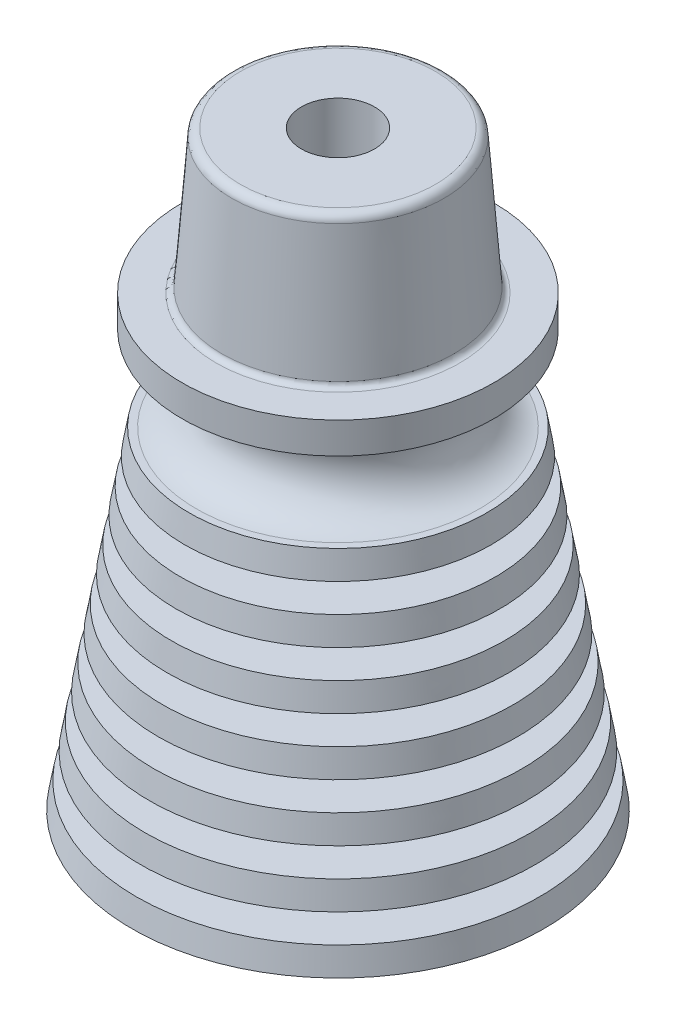
ISO-10303-21;
HEADER;
FILE_DESCRIPTION(('STEP AP214'),'2;1');
FILE_NAME('part.step','',(''),(''),'','','');
FILE_SCHEMA(('AUTOMOTIVE_DESIGN { 1 0 10303 214 1 1 1 1 }'));
ENDSEC;
DATA;
#1=APPLICATION_CONTEXT('core data for automotive mechanical design processes');
#2=APPLICATION_PROTOCOL_DEFINITION('international standard','automotive_design',2000,#1);
#3=PRODUCT_CONTEXT('',#1,'mechanical');
#4=PRODUCT('Part','Part','',(#3));
#5=PRODUCT_RELATED_PRODUCT_CATEGORY('part','',(#4));
#6=PRODUCT_DEFINITION_FORMATION('','',#4);
#7=PRODUCT_DEFINITION_CONTEXT('part definition',#1,'design');
#8=PRODUCT_DEFINITION('design','',#6,#7);
#9=PRODUCT_DEFINITION_SHAPE('','',#8);
#10=(LENGTH_UNIT() NAMED_UNIT(*) SI_UNIT(.MILLI.,.METRE.));
#11=(NAMED_UNIT(*) PLANE_ANGLE_UNIT() SI_UNIT($,.RADIAN.));
#12=(NAMED_UNIT(*) SI_UNIT($,.STERADIAN.) SOLID_ANGLE_UNIT());
#13=UNCERTAINTY_MEASURE_WITH_UNIT(LENGTH_MEASURE(1.E-05),#10,'distance_accuracy_value','');
#14=(GEOMETRIC_REPRESENTATION_CONTEXT(3) GLOBAL_UNCERTAINTY_ASSIGNED_CONTEXT((#13)) GLOBAL_UNIT_ASSIGNED_CONTEXT((#10,
#11,#12)) REPRESENTATION_CONTEXT('',''));
#15=CARTESIAN_POINT('',(0.,0.,0.));
#16=DIRECTION('',(0.,0.,1.));
#17=DIRECTION('',(1.,0.,0.));
#18=AXIS2_PLACEMENT_3D('',#15,#16,#17);
#19=CARTESIAN_POINT('',(0.,0.,0.));
#20=DIRECTION('',(0.,-1.,0.));
#21=DIRECTION('',(0.,0.,-1.));
#22=AXIS2_PLACEMENT_3D('',#19,#20,#21);
#23=CONICAL_SURFACE('',#22,6.23569725419736,0.111501419453793);
#24=CARTESIAN_POINT('',(0.,12.573,0.));
#25=DIRECTION('',(0.,1.,0.));
#26=DIRECTION('',(0.,0.,1.));
#27=AXIS2_PLACEMENT_3D('',#24,#25,#26);
#28=CIRCLE('',#27,4.82795110035121);
#29=CARTESIAN_POINT('',(0.,12.573,4.82795110035121));
#30=VERTEX_POINT('',#29);
#31=EDGE_CURVE('E56',#30,#30,#28,.F.);
#32=ORIENTED_EDGE('',*,*,#31,.F.);
#33=EDGE_LOOP('',(#32));
#34=FACE_BOUND('',#33,.T.);
#35=CARTESIAN_POINT('',(0.,13.716,0.));
#36=DIRECTION('',(0.,-1.,0.));
#37=DIRECTION('',(0.,0.,-1.));
#38=AXIS2_PLACEMENT_3D('',#35,#36,#37);
#39=CIRCLE('',#38,4.69997417727428);
#40=CARTESIAN_POINT('',(0.,13.716,-4.69997417727428));
#41=VERTEX_POINT('',#40);
#42=EDGE_CURVE('E89',#41,#41,#39,.F.);
#43=ORIENTED_EDGE('',*,*,#42,.F.);
#44=EDGE_LOOP('',(#43));
#45=FACE_BOUND('',#44,.T.);
#46=ADVANCED_FACE('F33',(#34,#45),#23,.T.);
#47=CARTESIAN_POINT('',(0.,9.144,0.));
#48=DIRECTION('',(0.,-1.,0.));
#49=DIRECTION('',(0.,0.,-1.));
#50=AXIS2_PLACEMENT_3D('',#47,#48,#49);
#51=CIRCLE('',#50,5.21188186958198);
#52=CARTESIAN_POINT('',(0.,9.144,-5.21188186958198));
#53=VERTEX_POINT('',#52);
#54=EDGE_CURVE('E62',#53,#53,#51,.F.);
#55=ORIENTED_EDGE('',*,*,#54,.F.);
#56=EDGE_LOOP('',(#55));
#57=FACE_BOUND('',#56,.T.);
#58=CARTESIAN_POINT('',(0.,8.001,0.));
#59=DIRECTION('',(0.,1.,0.));
#60=DIRECTION('',(0.,0.,1.));
#61=AXIS2_PLACEMENT_3D('',#58,#59,#60);
#62=CIRCLE('',#61,5.3398587926589);
#63=CARTESIAN_POINT('',(0.,8.001,5.3398587926589));
#64=VERTEX_POINT('',#63);
#65=EDGE_CURVE('E68',#64,#64,#62,.F.);
#66=ORIENTED_EDGE('',*,*,#65,.F.);
#67=EDGE_LOOP('',(#66));
#68=FACE_BOUND('',#67,.T.);
#69=ADVANCED_FACE('F173',(#57,#68),#23,.T.);
#70=CARTESIAN_POINT('',(0.,11.43,0.));
#71=DIRECTION('',(0.,-1.,0.));
#72=DIRECTION('',(0.,0.,-1.));
#73=AXIS2_PLACEMENT_3D('',#70,#71,#72);
#74=CIRCLE('',#73,4.95592802342813);
#75=CARTESIAN_POINT('',(0.,11.43,-4.95592802342813));
#76=VERTEX_POINT('',#75);
#77=EDGE_CURVE('E59',#76,#76,#74,.F.);
#78=ORIENTED_EDGE('',*,*,#77,.F.);
#79=EDGE_LOOP('',(#78));
#80=FACE_BOUND('',#79,.T.);
#81=CARTESIAN_POINT('',(0.,10.287,0.));
#82=DIRECTION('',(0.,1.,0.));
#83=DIRECTION('',(0.,0.,1.));
#84=AXIS2_PLACEMENT_3D('',#81,#82,#83);
#85=CIRCLE('',#84,5.08390494650505);
#86=CARTESIAN_POINT('',(0.,10.287,5.08390494650505));
#87=VERTEX_POINT('',#86);
#88=EDGE_CURVE('E65',#87,#87,#85,.F.);
#89=ORIENTED_EDGE('',*,*,#88,.F.);
#90=EDGE_LOOP('',(#89));
#91=FACE_BOUND('',#90,.T.);
#92=ADVANCED_FACE('F180',(#80,#91),#23,.T.);
#93=CARTESIAN_POINT('',(0.,6.858,0.));
#94=DIRECTION('',(0.,-1.,0.));
#95=DIRECTION('',(0.,0.,-1.));
#96=AXIS2_PLACEMENT_3D('',#93,#94,#95);
#97=CIRCLE('',#96,5.46783571573582);
#98=CARTESIAN_POINT('',(0.,6.858,-5.46783571573582));
#99=VERTEX_POINT('',#98);
#100=EDGE_CURVE('E71',#99,#99,#97,.F.);
#101=ORIENTED_EDGE('',*,*,#100,.F.);
#102=EDGE_LOOP('',(#101));
#103=FACE_BOUND('',#102,.T.);
#104=CARTESIAN_POINT('',(0.,5.715,0.));
#105=DIRECTION('',(0.,1.,0.));
#106=DIRECTION('',(0.,0.,1.));
#107=AXIS2_PLACEMENT_3D('',#104,#105,#106);
#108=CIRCLE('',#107,5.59581263881275);
#109=CARTESIAN_POINT('',(0.,5.715,5.59581263881275));
#110=VERTEX_POINT('',#109);
#111=EDGE_CURVE('E74',#110,#110,#108,.F.);
#112=ORIENTED_EDGE('',*,*,#111,.F.);
#113=EDGE_LOOP('',(#112));
#114=FACE_BOUND('',#113,.T.);
#115=ADVANCED_FACE('F202',(#103,#114),#23,.T.);
#116=CARTESIAN_POINT('',(0.,4.572,0.));
#117=DIRECTION('',(0.,-1.,0.));
#118=DIRECTION('',(0.,0.,-1.));
#119=AXIS2_PLACEMENT_3D('',#116,#117,#118);
#120=CIRCLE('',#119,5.72378956188967);
#121=CARTESIAN_POINT('',(0.,4.572,-5.72378956188967));
#122=VERTEX_POINT('',#121);
#123=EDGE_CURVE('E77',#122,#122,#120,.F.);
#124=ORIENTED_EDGE('',*,*,#123,.F.);
#125=EDGE_LOOP('',(#124));
#126=FACE_BOUND('',#125,.T.);
#127=CARTESIAN_POINT('',(0.,3.429,0.));
#128=DIRECTION('',(0.,1.,0.));
#129=DIRECTION('',(0.,0.,1.));
#130=AXIS2_PLACEMENT_3D('',#127,#128,#129);
#131=CIRCLE('',#130,5.85176648496659);
#132=CARTESIAN_POINT('',(0.,3.429,5.85176648496659));
#133=VERTEX_POINT('',#132);
#134=EDGE_CURVE('E80',#133,#133,#131,.F.);
#135=ORIENTED_EDGE('',*,*,#134,.F.);
#136=EDGE_LOOP('',(#135));
#137=FACE_BOUND('',#136,.T.);
#138=ADVANCED_FACE('F190',(#126,#137),#23,.T.);
#139=CARTESIAN_POINT('',(0.,14.859,0.));
#140=DIRECTION('',(0.,-1.,0.));
#141=DIRECTION('',(0.,0.,-1.));
#142=AXIS2_PLACEMENT_3D('',#139,#140,#141);
#143=CONICAL_SURFACE('',#142,2.5273,0.111501419453793);
#144=CARTESIAN_POINT('',(0.,0.,0.));
#145=DIRECTION('',(0.,-1.,0.));
#146=DIRECTION('',(0.,0.,-1.));
#147=AXIS2_PLACEMENT_3D('',#144,#145,#146);
#148=CIRCLE('',#147,4.191);
#149=CARTESIAN_POINT('',(0.,0.,-4.191));
#150=VERTEX_POINT('',#149);
#151=EDGE_CURVE('E92',#150,#150,#148,.T.);
#152=ORIENTED_EDGE('',*,*,#151,.T.);
#153=EDGE_LOOP('',(#152));
#154=FACE_BOUND('',#153,.T.);
#155=CARTESIAN_POINT('',(0.,14.859,0.));
#156=DIRECTION('',(0.,-1.,0.));
#157=DIRECTION('',(0.,0.,-1.));
#158=AXIS2_PLACEMENT_3D('',#155,#156,#157);
#159=CIRCLE('',#158,2.5273);
#160=CARTESIAN_POINT('',(0.,14.859,-2.5273));
#161=VERTEX_POINT('',#160);
#162=EDGE_CURVE('E95',#161,#161,#159,.T.);
#163=ORIENTED_EDGE('',*,*,#162,.F.);
#164=EDGE_LOOP('',(#163));
#165=FACE_BOUND('',#164,.T.);
#166=ADVANCED_FACE('F197',(#154,#165),#143,.F.);
#167=CARTESIAN_POINT('',(4.191,0.,0.));
#168=DIRECTION('',(0.,-1.,0.));
#169=DIRECTION('',(0.,0.,-1.));
#170=AXIS2_PLACEMENT_3D('',#167,#168,#169);
#171=PLANE('',#170);
#172=ORIENTED_EDGE('',*,*,#151,.F.);
#173=EDGE_LOOP('',(#172));
#174=FACE_BOUND('',#173,.T.);
#175=CARTESIAN_POINT('',(0.,0.,0.));
#176=DIRECTION('',(0.,-1.,0.));
#177=DIRECTION('',(0.,0.,-1.));
#178=AXIS2_PLACEMENT_3D('',#175,#176,#177);
#179=CIRCLE('',#178,9.2329);
#180=CARTESIAN_POINT('',(0.,0.,-9.2329));
#181=VERTEX_POINT('',#180);
#182=EDGE_CURVE('E107',#181,#181,#179,.T.);
#183=ORIENTED_EDGE('',*,*,#182,.T.);
#184=EDGE_LOOP('',(#183));
#185=FACE_BOUND('',#184,.T.);
#186=ADVANCED_FACE('F188',(#174,#185),#171,.T.);
#187=CARTESIAN_POINT('',(0.,2.286,0.));
#188=DIRECTION('',(0.,-1.,0.));
#189=DIRECTION('',(0.,0.,-1.));
#190=AXIS2_PLACEMENT_3D('',#187,#188,#189);
#191=CIRCLE('',#190,5.97974340804351);
#192=CARTESIAN_POINT('',(0.,2.286,-5.97974340804351));
#193=VERTEX_POINT('',#192);
#194=EDGE_CURVE('E83',#193,#193,#191,.F.);
#195=ORIENTED_EDGE('',*,*,#194,.F.);
#196=EDGE_LOOP('',(#195));
#197=FACE_BOUND('',#196,.T.);
#198=CARTESIAN_POINT('',(0.,1.143,0.));
#199=DIRECTION('',(0.,1.,0.));
#200=DIRECTION('',(0.,0.,1.));
#201=AXIS2_PLACEMENT_3D('',#198,#199,#200);
#202=CIRCLE('',#201,6.10772033112044);
#203=CARTESIAN_POINT('',(0.,1.143,6.10772033112044));
#204=VERTEX_POINT('',#203);
#205=EDGE_CURVE('E86',#204,#204,#202,.F.);
#206=ORIENTED_EDGE('',*,*,#205,.F.);
#207=EDGE_LOOP('',(#206));
#208=FACE_BOUND('',#207,.T.);
#209=ADVANCED_FACE('F176',(#197,#208),#23,.T.);
#210=CARTESIAN_POINT('',(4.57199725419736,14.859,0.));
#211=DIRECTION('',(0.,1.,0.));
#212=DIRECTION('',(0.,0.,1.));
#213=AXIS2_PLACEMENT_3D('',#210,#211,#212);
#214=PLANE('',#213);
#215=CARTESIAN_POINT('',(0.,14.859,0.));
#216=DIRECTION('',(0.,-1.,0.));
#217=DIRECTION('',(0.,0.,-1.));
#218=AXIS2_PLACEMENT_3D('',#215,#216,#217);
#219=CIRCLE('',#218,6.35000000000002);
#220=CARTESIAN_POINT('',(0.,14.859,-6.35000000000002));
#221=VERTEX_POINT('',#220);
#222=EDGE_CURVE('E53',#221,#221,#219,.F.);
#223=ORIENTED_EDGE('',*,*,#222,.F.);
#224=EDGE_LOOP('',(#223));
#225=FACE_BOUND('',#224,.T.);
#226=CARTESIAN_POINT('',(0.,14.859,0.));
#227=DIRECTION('',(0.,-1.,0.));
#228=DIRECTION('',(0.,0.,-1.));
#229=AXIS2_PLACEMENT_3D('',#226,#227,#228);
#230=CIRCLE('',#229,6.6675);
#231=CARTESIAN_POINT('',(0.,14.859,-6.6675));
#232=VERTEX_POINT('',#231);
#233=EDGE_CURVE('E98',#232,#232,#230,.T.);
#234=ORIENTED_EDGE('',*,*,#233,.F.);
#235=EDGE_LOOP('',(#234));
#236=FACE_BOUND('',#235,.T.);
#237=ADVANCED_FACE('F187',(#225,#236),#214,.T.);
#238=CARTESIAN_POINT('',(0.,13.716,0.));
#239=DIRECTION('',(0.,-1.,0.));
#240=DIRECTION('',(0.,0.,-1.));
#241=AXIS2_PLACEMENT_3D('',#238,#239,#240);
#242=CONICAL_SURFACE('',#241,6.86483846153846,0.170964175409462);
#243=ORIENTED_EDGE('',*,*,#233,.T.);
#244=EDGE_LOOP('',(#243));
#245=FACE_BOUND('',#244,.T.);
#246=CARTESIAN_POINT('',(0.,13.716,0.));
#247=DIRECTION('',(0.,-1.,0.));
#248=DIRECTION('',(0.,0.,-1.));
#249=AXIS2_PLACEMENT_3D('',#246,#247,#248);
#250=CIRCLE('',#249,6.86483846153846);
#251=CARTESIAN_POINT('',(0.,13.716,-6.86483846153846));
#252=VERTEX_POINT('',#251);
#253=EDGE_CURVE('E101',#252,#252,#250,.T.);
#254=ORIENTED_EDGE('',*,*,#253,.F.);
#255=EDGE_LOOP('',(#254));
#256=FACE_BOUND('',#255,.T.);
#257=ADVANCED_FACE('F195',(#245,#256),#242,.T.);
#258=CARTESIAN_POINT('',(4.69997417727428,13.716,0.));
#259=DIRECTION('',(0.,-1.,0.));
#260=DIRECTION('',(0.,0.,-1.));
#261=AXIS2_PLACEMENT_3D('',#258,#259,#260);
#262=PLANE('',#261);
#263=ORIENTED_EDGE('',*,*,#253,.T.);
#264=EDGE_LOOP('',(#263));
#265=FACE_BOUND('',#264,.T.);
#266=ORIENTED_EDGE('',*,*,#42,.T.);
#267=EDGE_LOOP('',(#266));
#268=FACE_BOUND('',#267,.T.);
#269=ADVANCED_FACE('F247',(#265,#268),#262,.T.);
#270=CARTESIAN_POINT('',(0.,0.,0.));
#271=DIRECTION('',(0.,-1.,0.));
#272=DIRECTION('',(0.,0.,-1.));
#273=AXIS2_PLACEMENT_3D('',#270,#271,#272);
#274=CONICAL_SURFACE('',#273,9.2329,0.170964175409462);
#275=CARTESIAN_POINT('',(0.,1.143,0.));
#276=DIRECTION('',(0.,-1.,0.));
#277=DIRECTION('',(0.,0.,-1.));
#278=AXIS2_PLACEMENT_3D('',#275,#276,#277);
#279=CIRCLE('',#278,9.03556153846154);
#280=CARTESIAN_POINT('',(0.,1.143,-9.03556153846154));
#281=VERTEX_POINT('',#280);
#282=EDGE_CURVE('E104',#281,#281,#279,.T.);
#283=ORIENTED_EDGE('',*,*,#282,.T.);
#284=EDGE_LOOP('',(#283));
#285=FACE_BOUND('',#284,.T.);
#286=ORIENTED_EDGE('',*,*,#182,.F.);
#287=EDGE_LOOP('',(#286));
#288=FACE_BOUND('',#287,.T.);
#289=ADVANCED_FACE('F243',(#285,#288),#274,.T.);
#290=CARTESIAN_POINT('',(6.10772033112044,1.143,0.));
#291=DIRECTION('',(0.,1.,0.));
#292=DIRECTION('',(0.,0.,1.));
#293=AXIS2_PLACEMENT_3D('',#290,#291,#292);
#294=PLANE('',#293);
#295=ORIENTED_EDGE('',*,*,#205,.T.);
#296=EDGE_LOOP('',(#295));
#297=FACE_BOUND('',#296,.T.);
#298=ORIENTED_EDGE('',*,*,#282,.F.);
#299=EDGE_LOOP('',(#298));
#300=FACE_BOUND('',#299,.T.);
#301=ADVANCED_FACE('F225',(#297,#300),#294,.T.);
#302=CARTESIAN_POINT('',(0.,2.286,0.));
#303=DIRECTION('',(0.,-1.,0.));
#304=DIRECTION('',(0.,0.,-1.));
#305=AXIS2_PLACEMENT_3D('',#302,#303,#304);
#306=CONICAL_SURFACE('',#305,8.83822307692308,0.170964175409462);
#307=CARTESIAN_POINT('',(0.,3.429,0.));
#308=DIRECTION('',(0.,-1.,0.));
#309=DIRECTION('',(0.,0.,-1.));
#310=AXIS2_PLACEMENT_3D('',#307,#308,#309);
#311=CIRCLE('',#310,8.64088461538461);
#312=CARTESIAN_POINT('',(0.,3.429,-8.64088461538461));
#313=VERTEX_POINT('',#312);
#314=EDGE_CURVE('E110',#313,#313,#311,.T.);
#315=ORIENTED_EDGE('',*,*,#314,.T.);
#316=EDGE_LOOP('',(#315));
#317=FACE_BOUND('',#316,.T.);
#318=CARTESIAN_POINT('',(0.,2.286,0.));
#319=DIRECTION('',(0.,-1.,0.));
#320=DIRECTION('',(0.,0.,-1.));
#321=AXIS2_PLACEMENT_3D('',#318,#319,#320);
#322=CIRCLE('',#321,8.83822307692308);
#323=CARTESIAN_POINT('',(0.,2.286,-8.83822307692308));
#324=VERTEX_POINT('',#323);
#325=EDGE_CURVE('E113',#324,#324,#322,.T.);
#326=ORIENTED_EDGE('',*,*,#325,.F.);
#327=EDGE_LOOP('',(#326));
#328=FACE_BOUND('',#327,.T.);
#329=ADVANCED_FACE('F219',(#317,#328),#306,.T.);
#330=CARTESIAN_POINT('',(5.85176648496659,3.429,0.));
#331=DIRECTION('',(0.,1.,0.));
#332=DIRECTION('',(0.,0.,1.));
#333=AXIS2_PLACEMENT_3D('',#330,#331,#332);
#334=PLANE('',#333);
#335=ORIENTED_EDGE('',*,*,#134,.T.);
#336=EDGE_LOOP('',(#335));
#337=FACE_BOUND('',#336,.T.);
#338=ORIENTED_EDGE('',*,*,#314,.F.);
#339=EDGE_LOOP('',(#338));
#340=FACE_BOUND('',#339,.T.);
#341=ADVANCED_FACE('F215',(#337,#340),#334,.T.);
#342=CARTESIAN_POINT('',(5.97974340804352,2.286,0.));
#343=DIRECTION('',(0.,-1.,0.));
#344=DIRECTION('',(0.,0.,-1.));
#345=AXIS2_PLACEMENT_3D('',#342,#343,#344);
#346=PLANE('',#345);
#347=ORIENTED_EDGE('',*,*,#325,.T.);
#348=EDGE_LOOP('',(#347));
#349=FACE_BOUND('',#348,.T.);
#350=ORIENTED_EDGE('',*,*,#194,.T.);
#351=EDGE_LOOP('',(#350));
#352=FACE_BOUND('',#351,.T.);
#353=ADVANCED_FACE('F218',(#349,#352),#346,.T.);
#354=CARTESIAN_POINT('',(0.,4.572,0.));
#355=DIRECTION('',(0.,-1.,0.));
#356=DIRECTION('',(0.,0.,-1.));
#357=AXIS2_PLACEMENT_3D('',#354,#355,#356);
#358=CONICAL_SURFACE('',#357,8.44354615384615,0.17096417540946);
#359=CARTESIAN_POINT('',(0.,5.715,0.));
#360=DIRECTION('',(0.,-1.,0.));
#361=DIRECTION('',(0.,0.,-1.));
#362=AXIS2_PLACEMENT_3D('',#359,#360,#361);
#363=CIRCLE('',#362,8.24620769230769);
#364=CARTESIAN_POINT('',(0.,5.715,-8.24620769230769));
#365=VERTEX_POINT('',#364);
#366=EDGE_CURVE('E116',#365,#365,#363,.T.);
#367=ORIENTED_EDGE('',*,*,#366,.T.);
#368=EDGE_LOOP('',(#367));
#369=FACE_BOUND('',#368,.T.);
#370=CARTESIAN_POINT('',(0.,4.572,0.));
#371=DIRECTION('',(0.,-1.,0.));
#372=DIRECTION('',(0.,0.,-1.));
#373=AXIS2_PLACEMENT_3D('',#370,#371,#372);
#374=CIRCLE('',#373,8.44354615384615);
#375=CARTESIAN_POINT('',(0.,4.572,-8.44354615384615));
#376=VERTEX_POINT('',#375);
#377=EDGE_CURVE('E119',#376,#376,#374,.T.);
#378=ORIENTED_EDGE('',*,*,#377,.F.);
#379=EDGE_LOOP('',(#378));
#380=FACE_BOUND('',#379,.T.);
#381=ADVANCED_FACE('F231',(#369,#380),#358,.T.);
#382=CARTESIAN_POINT('',(5.59581263881275,5.715,0.));
#383=DIRECTION('',(0.,1.,0.));
#384=DIRECTION('',(0.,0.,1.));
#385=AXIS2_PLACEMENT_3D('',#382,#383,#384);
#386=PLANE('',#385);
#387=ORIENTED_EDGE('',*,*,#111,.T.);
#388=EDGE_LOOP('',(#387));
#389=FACE_BOUND('',#388,.T.);
#390=ORIENTED_EDGE('',*,*,#366,.F.);
#391=EDGE_LOOP('',(#390));
#392=FACE_BOUND('',#391,.T.);
#393=ADVANCED_FACE('F236',(#389,#392),#386,.T.);
#394=CARTESIAN_POINT('',(5.72378956188967,4.572,0.));
#395=DIRECTION('',(0.,-1.,0.));
#396=DIRECTION('',(0.,0.,-1.));
#397=AXIS2_PLACEMENT_3D('',#394,#395,#396);
#398=PLANE('',#397);
#399=ORIENTED_EDGE('',*,*,#377,.T.);
#400=EDGE_LOOP('',(#399));
#401=FACE_BOUND('',#400,.T.);
#402=ORIENTED_EDGE('',*,*,#123,.T.);
#403=EDGE_LOOP('',(#402));
#404=FACE_BOUND('',#403,.T.);
#405=ADVANCED_FACE('F303',(#401,#404),#398,.T.);
#406=CARTESIAN_POINT('',(0.,6.858,0.));
#407=DIRECTION('',(0.,-1.,0.));
#408=DIRECTION('',(0.,0.,-1.));
#409=AXIS2_PLACEMENT_3D('',#406,#407,#408);
#410=CONICAL_SURFACE('',#409,8.04886923076923,0.170964175409462);
#411=CARTESIAN_POINT('',(0.,8.001,0.));
#412=DIRECTION('',(0.,-1.,0.));
#413=DIRECTION('',(0.,0.,-1.));
#414=AXIS2_PLACEMENT_3D('',#411,#412,#413);
#415=CIRCLE('',#414,7.85153076923077);
#416=CARTESIAN_POINT('',(0.,8.001,-7.85153076923077));
#417=VERTEX_POINT('',#416);
#418=EDGE_CURVE('E122',#417,#417,#415,.T.);
#419=ORIENTED_EDGE('',*,*,#418,.T.);
#420=EDGE_LOOP('',(#419));
#421=FACE_BOUND('',#420,.T.);
#422=CARTESIAN_POINT('',(0.,6.858,0.));
#423=DIRECTION('',(0.,-1.,0.));
#424=DIRECTION('',(0.,0.,-1.));
#425=AXIS2_PLACEMENT_3D('',#422,#423,#424);
#426=CIRCLE('',#425,8.04886923076923);
#427=CARTESIAN_POINT('',(0.,6.858,-8.04886923076923));
#428=VERTEX_POINT('',#427);
#429=EDGE_CURVE('E125',#428,#428,#426,.T.);
#430=ORIENTED_EDGE('',*,*,#429,.F.);
#431=EDGE_LOOP('',(#430));
#432=FACE_BOUND('',#431,.T.);
#433=ADVANCED_FACE('F312',(#421,#432),#410,.T.);
#434=CARTESIAN_POINT('',(5.3398587926589,8.001,0.));
#435=DIRECTION('',(0.,1.,0.));
#436=DIRECTION('',(0.,0.,1.));
#437=AXIS2_PLACEMENT_3D('',#434,#435,#436);
#438=PLANE('',#437);
#439=ORIENTED_EDGE('',*,*,#65,.T.);
#440=EDGE_LOOP('',(#439));
#441=FACE_BOUND('',#440,.T.);
#442=ORIENTED_EDGE('',*,*,#418,.F.);
#443=EDGE_LOOP('',(#442));
#444=FACE_BOUND('',#443,.T.);
#445=ADVANCED_FACE('F322',(#441,#444),#438,.T.);
#446=CARTESIAN_POINT('',(5.46783571573582,6.858,0.));
#447=DIRECTION('',(0.,-1.,0.));
#448=DIRECTION('',(0.,0.,-1.));
#449=AXIS2_PLACEMENT_3D('',#446,#447,#448);
#450=PLANE('',#449);
#451=ORIENTED_EDGE('',*,*,#429,.T.);
#452=EDGE_LOOP('',(#451));
#453=FACE_BOUND('',#452,.T.);
#454=ORIENTED_EDGE('',*,*,#100,.T.);
#455=EDGE_LOOP('',(#454));
#456=FACE_BOUND('',#455,.T.);
#457=ADVANCED_FACE('F332',(#453,#456),#450,.T.);
#458=CARTESIAN_POINT('',(5.21188186958198,9.144,0.));
#459=DIRECTION('',(0.,-1.,0.));
#460=DIRECTION('',(0.,0.,-1.));
#461=AXIS2_PLACEMENT_3D('',#458,#459,#460);
#462=PLANE('',#461);
#463=CARTESIAN_POINT('',(0.,9.144,0.));
#464=DIRECTION('',(0.,-1.,0.));
#465=DIRECTION('',(0.,0.,-1.));
#466=AXIS2_PLACEMENT_3D('',#463,#464,#465);
#467=CIRCLE('',#466,7.65419230769231);
#468=CARTESIAN_POINT('',(0.,9.144,-7.65419230769231));
#469=VERTEX_POINT('',#468);
#470=EDGE_CURVE('E128',#469,#469,#467,.T.);
#471=ORIENTED_EDGE('',*,*,#470,.T.);
#472=EDGE_LOOP('',(#471));
#473=FACE_BOUND('',#472,.T.);
#474=ORIENTED_EDGE('',*,*,#54,.T.);
#475=EDGE_LOOP('',(#474));
#476=FACE_BOUND('',#475,.T.);
#477=ADVANCED_FACE('F342',(#473,#476),#462,.T.);
#478=CARTESIAN_POINT('',(0.,9.144,0.));
#479=DIRECTION('',(0.,-1.,0.));
#480=DIRECTION('',(0.,0.,-1.));
#481=AXIS2_PLACEMENT_3D('',#478,#479,#480);
#482=CONICAL_SURFACE('',#481,7.65419230769231,0.170964175409462);
#483=CARTESIAN_POINT('',(0.,10.287,0.));
#484=DIRECTION('',(0.,-1.,0.));
#485=DIRECTION('',(0.,0.,-1.));
#486=AXIS2_PLACEMENT_3D('',#483,#484,#485);
#487=CIRCLE('',#486,7.45685384615385);
#488=CARTESIAN_POINT('',(0.,10.287,-7.45685384615385));
#489=VERTEX_POINT('',#488);
#490=EDGE_CURVE('E131',#489,#489,#487,.T.);
#491=ORIENTED_EDGE('',*,*,#490,.T.);
#492=EDGE_LOOP('',(#491));
#493=FACE_BOUND('',#492,.T.);
#494=ORIENTED_EDGE('',*,*,#470,.F.);
#495=EDGE_LOOP('',(#494));
#496=FACE_BOUND('',#495,.T.);
#497=ADVANCED_FACE('F352',(#493,#496),#482,.T.);
#498=CARTESIAN_POINT('',(5.08390494650505,10.287,0.));
#499=DIRECTION('',(0.,1.,0.));
#500=DIRECTION('',(0.,0.,1.));
#501=AXIS2_PLACEMENT_3D('',#498,#499,#500);
#502=PLANE('',#501);
#503=ORIENTED_EDGE('',*,*,#88,.T.);
#504=EDGE_LOOP('',(#503));
#505=FACE_BOUND('',#504,.T.);
#506=ORIENTED_EDGE('',*,*,#490,.F.);
#507=EDGE_LOOP('',(#506));
#508=FACE_BOUND('',#507,.T.);
#509=ADVANCED_FACE('F362',(#505,#508),#502,.T.);
#510=CARTESIAN_POINT('',(0.,11.43,0.));
#511=DIRECTION('',(0.,-1.,0.));
#512=DIRECTION('',(0.,0.,-1.));
#513=AXIS2_PLACEMENT_3D('',#510,#511,#512);
#514=CONICAL_SURFACE('',#513,7.25951538461538,0.170964175409461);
#515=CARTESIAN_POINT('',(0.,12.573,0.));
#516=DIRECTION('',(0.,-1.,0.));
#517=DIRECTION('',(0.,0.,-1.));
#518=AXIS2_PLACEMENT_3D('',#515,#516,#517);
#519=CIRCLE('',#518,7.06217692307692);
#520=CARTESIAN_POINT('',(0.,12.573,-7.06217692307692));
#521=VERTEX_POINT('',#520);
#522=EDGE_CURVE('E134',#521,#521,#519,.T.);
#523=ORIENTED_EDGE('',*,*,#522,.T.);
#524=EDGE_LOOP('',(#523));
#525=FACE_BOUND('',#524,.T.);
#526=CARTESIAN_POINT('',(0.,11.43,0.));
#527=DIRECTION('',(0.,-1.,0.));
#528=DIRECTION('',(0.,0.,-1.));
#529=AXIS2_PLACEMENT_3D('',#526,#527,#528);
#530=CIRCLE('',#529,7.25951538461538);
#531=CARTESIAN_POINT('',(0.,11.43,-7.25951538461538));
#532=VERTEX_POINT('',#531);
#533=EDGE_CURVE('E137',#532,#532,#530,.T.);
#534=ORIENTED_EDGE('',*,*,#533,.F.);
#535=EDGE_LOOP('',(#534));
#536=FACE_BOUND('',#535,.T.);
#537=ADVANCED_FACE('F372',(#525,#536),#514,.T.);
#538=CARTESIAN_POINT('',(4.82795110035121,12.573,0.));
#539=DIRECTION('',(0.,1.,0.));
#540=DIRECTION('',(0.,0.,1.));
#541=AXIS2_PLACEMENT_3D('',#538,#539,#540);
#542=PLANE('',#541);
#543=ORIENTED_EDGE('',*,*,#31,.T.);
#544=EDGE_LOOP('',(#543));
#545=FACE_BOUND('',#544,.T.);
#546=ORIENTED_EDGE('',*,*,#522,.F.);
#547=EDGE_LOOP('',(#546));
#548=FACE_BOUND('',#547,.T.);
#549=ADVANCED_FACE('F382',(#545,#548),#542,.T.);
#550=CARTESIAN_POINT('',(4.95592802342813,11.43,0.));
#551=DIRECTION('',(0.,-1.,0.));
#552=DIRECTION('',(0.,0.,-1.));
#553=AXIS2_PLACEMENT_3D('',#550,#551,#552);
#554=PLANE('',#553);
#555=ORIENTED_EDGE('',*,*,#533,.T.);
#556=EDGE_LOOP('',(#555));
#557=FACE_BOUND('',#556,.T.);
#558=ORIENTED_EDGE('',*,*,#77,.T.);
#559=EDGE_LOOP('',(#558));
#560=FACE_BOUND('',#559,.T.);
#561=ADVANCED_FACE('F392',(#557,#560),#554,.T.);
#562=CARTESIAN_POINT('',(0.,20.066,0.));
#563=DIRECTION('',(0.,1.,0.));
#564=DIRECTION('',(0.,0.,1.));
#565=AXIS2_PLACEMENT_3D('',#562,#563,#564);
#566=PLANE('',#565);
#567=CARTESIAN_POINT('',(0.,20.066,0.));
#568=DIRECTION('',(0.,1.,0.));
#569=DIRECTION('',(0.,0.,1.));
#570=AXIS2_PLACEMENT_3D('',#567,#568,#569);
#571=CIRCLE('',#570,5.45513627775538);
#572=CARTESIAN_POINT('',(0.,20.066,5.45513627775538));
#573=VERTEX_POINT('',#572);
#574=EDGE_CURVE('E10',#573,#573,#571,.F.);
#575=ORIENTED_EDGE('',*,*,#574,.T.);
#576=EDGE_LOOP('',(#575));
#577=FACE_BOUND('',#576,.T.);
#578=CARTESIAN_POINT('',(0.,20.066,0.));
#579=DIRECTION('',(0.,-1.,0.));
#580=DIRECTION('',(0.,0.,-1.));
#581=AXIS2_PLACEMENT_3D('',#578,#579,#580);
#582=CIRCLE('',#581,6.985);
#583=CARTESIAN_POINT('',(0.,20.066,-6.985));
#584=VERTEX_POINT('',#583);
#585=EDGE_CURVE('E146',#584,#584,#582,.T.);
#586=ORIENTED_EDGE('',*,*,#585,.F.);
#587=EDGE_LOOP('',(#586));
#588=FACE_BOUND('',#587,.T.);
#589=ADVANCED_FACE('F401',(#577,#588),#566,.T.);
#590=CARTESIAN_POINT('',(0.,0.,0.));
#591=DIRECTION('',(0.,-1.,0.));
#592=DIRECTION('',(0.,0.,-1.));
#593=AXIS2_PLACEMENT_3D('',#590,#591,#592);
#594=CYLINDRICAL_SURFACE('',#593,6.985);
#595=ORIENTED_EDGE('',*,*,#585,.T.);
#596=EDGE_LOOP('',(#595));
#597=FACE_BOUND('',#596,.T.);
#598=CARTESIAN_POINT('',(0.,18.669,0.));
#599=DIRECTION('',(0.,-1.,0.));
#600=DIRECTION('',(0.,0.,-1.));
#601=AXIS2_PLACEMENT_3D('',#598,#599,#600);
#602=CIRCLE('',#601,6.985);
#603=CARTESIAN_POINT('',(0.,18.669,-6.985));
#604=VERTEX_POINT('',#603);
#605=EDGE_CURVE('E143',#604,#604,#602,.T.);
#606=ORIENTED_EDGE('',*,*,#605,.F.);
#607=EDGE_LOOP('',(#606));
#608=FACE_BOUND('',#607,.T.);
#609=ADVANCED_FACE('F416',(#597,#608),#594,.T.);
#610=CARTESIAN_POINT('',(6.35,18.669,0.));
#611=DIRECTION('',(0.,-1.,0.));
#612=DIRECTION('',(0.,0.,-1.));
#613=AXIS2_PLACEMENT_3D('',#610,#611,#612);
#614=PLANE('',#613);
#615=ORIENTED_EDGE('',*,*,#605,.T.);
#616=EDGE_LOOP('',(#615));
#617=FACE_BOUND('',#616,.T.);
#618=CARTESIAN_POINT('',(0.,18.669,0.));
#619=DIRECTION('',(0.,-1.,0.));
#620=DIRECTION('',(0.,0.,-1.));
#621=AXIS2_PLACEMENT_3D('',#618,#619,#620);
#622=CIRCLE('',#621,6.35);
#623=CARTESIAN_POINT('',(0.,18.669,-6.35));
#624=VERTEX_POINT('',#623);
#625=EDGE_CURVE('E140',#624,#624,#622,.T.);
#626=ORIENTED_EDGE('',*,*,#625,.F.);
#627=EDGE_LOOP('',(#626));
#628=FACE_BOUND('',#627,.T.);
#629=ADVANCED_FACE('F421',(#617,#628),#614,.T.);
#630=CARTESIAN_POINT('',(0.,16.764,0.));
#631=DIRECTION('',(0.,-1.,0.));
#632=DIRECTION('',(0.,0.,-1.));
#633=AXIS2_PLACEMENT_3D('',#630,#631,#632);
#634=TOROIDAL_SURFACE('',#633,6.60879885496183,1.92249885496183);
#635=ORIENTED_EDGE('',*,*,#625,.T.);
#636=EDGE_LOOP('',(#635));
#637=FACE_BOUND('',#636,.T.);
#638=ORIENTED_EDGE('',*,*,#222,.T.);
#639=EDGE_LOOP('',(#638));
#640=FACE_BOUND('',#639,.T.);
#641=ADVANCED_FACE('F431',(#637,#640),#634,.F.);
#642=CARTESIAN_POINT('',(6.35,14.859,0.));
#643=DIRECTION('',(0.,-1.,0.));
#644=DIRECTION('',(0.,0.,-1.));
#645=AXIS2_PLACEMENT_3D('',#642,#643,#644);
#646=PLANE('',#645);
#647=CARTESIAN_POINT('',(0.,14.859,0.));
#648=DIRECTION('',(0.,-1.,0.));
#649=DIRECTION('',(0.,0.,-1.));
#650=AXIS2_PLACEMENT_3D('',#647,#648,#649);
#651=CIRCLE('',#650,1.6383);
#652=CARTESIAN_POINT('',(0.,14.859,-1.6383));
#653=VERTEX_POINT('',#652);
#654=EDGE_CURVE('E149',#653,#653,#651,.T.);
#655=ORIENTED_EDGE('',*,*,#654,.F.);
#656=EDGE_LOOP('',(#655));
#657=FACE_BOUND('',#656,.T.);
#658=ORIENTED_EDGE('',*,*,#162,.T.);
#659=EDGE_LOOP('',(#658));
#660=FACE_BOUND('',#659,.T.);
#661=ADVANCED_FACE('F170',(#657,#660),#646,.T.);
#662=CARTESIAN_POINT('',(0.,20.066,0.));
#663=DIRECTION('',(0.,-1.,0.));
#664=DIRECTION('',(0.,0.,-1.));
#665=AXIS2_PLACEMENT_3D('',#662,#663,#664);
#666=CONICAL_SURFACE('',#665,5.2197,0.0758212208051455);
#667=CARTESIAN_POINT('',(0.,20.3007598570939,0.));
#668=DIRECTION('',(0.,-1.,0.));
#669=DIRECTION('',(0.,0.,-1.));
#670=AXIS2_PLACEMENT_3D('',#667,#668,#669);
#671=CIRCLE('',#670,5.20186603295557);
#672=CARTESIAN_POINT('',(0.,20.3007598570939,-5.20186603295557));
#673=VERTEX_POINT('',#672);
#674=EDGE_CURVE('E40',#673,#673,#671,.F.);
#675=ORIENTED_EDGE('',*,*,#674,.T.);
#676=EDGE_LOOP('',(#675));
#677=FACE_BOUND('',#676,.T.);
#678=CARTESIAN_POINT('',(0.,26.1146602143591,0.));
#679=DIRECTION('',(0.,1.,0.));
#680=DIRECTION('',(0.,0.,1.));
#681=AXIS2_PLACEMENT_3D('',#678,#679,#680);
#682=CIRCLE('',#681,4.76020233178211);
#683=CARTESIAN_POINT('',(0.,26.1146602143591,4.76020233178211));
#684=VERTEX_POINT('',#683);
#685=EDGE_CURVE('E48',#684,#684,#682,.F.);
#686=ORIENTED_EDGE('',*,*,#685,.T.);
#687=EDGE_LOOP('',(#686));
#688=FACE_BOUND('',#687,.T.);
#689=ADVANCED_FACE('F160',(#677,#688),#666,.T.);
#690=CARTESIAN_POINT('',(0.,26.4668,0.));
#691=DIRECTION('',(0.,1.,0.));
#692=DIRECTION('',(0.,0.,1.));
#693=AXIS2_PLACEMENT_3D('',#690,#691,#692);
#694=PLANE('',#693);
#695=CARTESIAN_POINT('',(0.,26.4668,0.));
#696=DIRECTION('',(0.,1.,0.));
#697=DIRECTION('',(0.,0.,1.));
#698=AXIS2_PLACEMENT_3D('',#695,#696,#697);
#699=CIRCLE('',#698,4.3802969645824);
#700=CARTESIAN_POINT('',(0.,26.4668,4.3802969645824));
#701=VERTEX_POINT('',#700);
#702=EDGE_CURVE('E44',#701,#701,#699,.T.);
#703=ORIENTED_EDGE('',*,*,#702,.T.);
#704=EDGE_LOOP('',(#703));
#705=FACE_BOUND('',#704,.T.);
#706=CARTESIAN_POINT('',(0.,26.4668,0.));
#707=DIRECTION('',(0.,1.,0.));
#708=DIRECTION('',(0.,0.,1.));
#709=AXIS2_PLACEMENT_3D('',#706,#707,#708);
#710=CIRCLE('',#709,1.6383);
#711=CARTESIAN_POINT('',(0.,26.4668,1.6383));
#712=VERTEX_POINT('',#711);
#713=EDGE_CURVE('E152',#712,#712,#710,.T.);
#714=ORIENTED_EDGE('',*,*,#713,.F.);
#715=EDGE_LOOP('',(#714));
#716=FACE_BOUND('',#715,.T.);
#717=ADVANCED_FACE('F158',(#705,#716),#694,.T.);
#718=CARTESIAN_POINT('',(0.,0.,0.));
#719=DIRECTION('',(0.,1.,0.));
#720=DIRECTION('',(0.,0.,1.));
#721=AXIS2_PLACEMENT_3D('',#718,#719,#720);
#722=CYLINDRICAL_SURFACE('',#721,1.6383);
#723=ORIENTED_EDGE('',*,*,#654,.T.);
#724=EDGE_LOOP('',(#723));
#725=FACE_BOUND('',#724,.T.);
#726=ORIENTED_EDGE('',*,*,#713,.T.);
#727=EDGE_LOOP('',(#726));
#728=FACE_BOUND('',#727,.T.);
#729=ADVANCED_FACE('F156',(#725,#728),#722,.F.);
#730=CARTESIAN_POINT('',(0.,26.0858,0.));
#731=DIRECTION('',(0.,1.,0.));
#732=DIRECTION('',(0.,0.,1.));
#733=AXIS2_PLACEMENT_3D('',#730,#731,#732);
#734=TOROIDAL_SURFACE('',#733,4.3802969645824,0.381);
#735=ORIENTED_EDGE('',*,*,#702,.F.);
#736=EDGE_LOOP('',(#735));
#737=FACE_BOUND('',#736,.T.);
#738=ORIENTED_EDGE('',*,*,#685,.F.);
#739=EDGE_LOOP('',(#738));
#740=FACE_BOUND('',#739,.T.);
#741=ADVANCED_FACE('F167',(#737,#740),#734,.T.);
#742=CARTESIAN_POINT('',(0.,20.32,0.));
#743=DIRECTION('',(0.,1.,0.));
#744=DIRECTION('',(0.,0.,1.));
#745=AXIS2_PLACEMENT_3D('',#742,#743,#744);
#746=TOROIDAL_SURFACE('',#745,5.45513627775538,0.254);
#747=ORIENTED_EDGE('',*,*,#574,.F.);
#748=EDGE_LOOP('',(#747));
#749=FACE_BOUND('',#748,.T.);
#750=ORIENTED_EDGE('',*,*,#674,.F.);
#751=EDGE_LOOP('',(#750));
#752=FACE_BOUND('',#751,.T.);
#753=ADVANCED_FACE('F35',(#749,#752),#746,.F.);
#754=CLOSED_SHELL('',(#46,#69,#92,#115,#138,#166,#186,#209,#237,#257,#269,#289,#301,#329,#341,
#353,#381,#393,#405,#433,#445,#457,#477,#497,#509,#537,#549,#561,#589,#609,#629,#641,#661,#689,
#717,#729,#741,#753));
#755=MANIFOLD_SOLID_BREP('B2',#754);
#756=ADVANCED_BREP_SHAPE_REPRESENTATION('',(#18,#755),#14);
#757=SHAPE_DEFINITION_REPRESENTATION(#9,#756);
ENDSEC;
END-ISO-10303-21;
